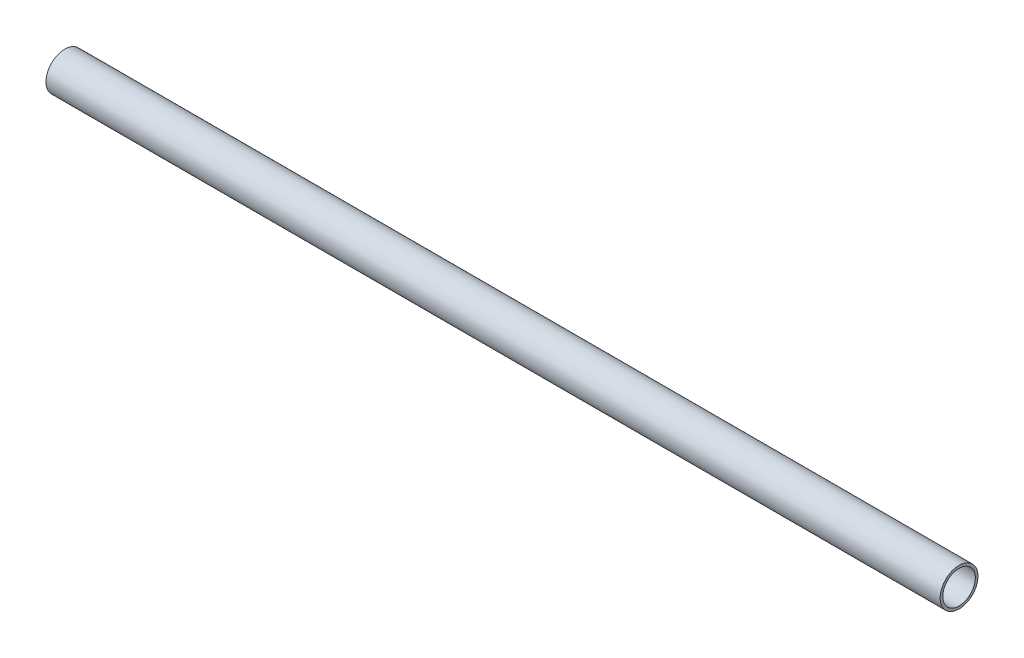
ISO-10303-21;
HEADER;
FILE_DESCRIPTION(('STEP AP214'),'2;1');
FILE_NAME('part.step','',(''),(''),'','','');
FILE_SCHEMA(('AUTOMOTIVE_DESIGN { 1 0 10303 214 1 1 1 1 }'));
ENDSEC;
DATA;
#1=APPLICATION_CONTEXT('core data for automotive mechanical design processes');
#2=APPLICATION_PROTOCOL_DEFINITION('international standard','automotive_design',2000,#1);
#3=PRODUCT_CONTEXT('',#1,'mechanical');
#4=PRODUCT('Part','Part','',(#3));
#5=PRODUCT_RELATED_PRODUCT_CATEGORY('part','',(#4));
#6=PRODUCT_DEFINITION_FORMATION('','',#4);
#7=PRODUCT_DEFINITION_CONTEXT('part definition',#1,'design');
#8=PRODUCT_DEFINITION('design','',#6,#7);
#9=PRODUCT_DEFINITION_SHAPE('','',#8);
#10=(LENGTH_UNIT() NAMED_UNIT(*) SI_UNIT(.MILLI.,.METRE.));
#11=(NAMED_UNIT(*) PLANE_ANGLE_UNIT() SI_UNIT($,.RADIAN.));
#12=(NAMED_UNIT(*) SI_UNIT($,.STERADIAN.) SOLID_ANGLE_UNIT());
#13=UNCERTAINTY_MEASURE_WITH_UNIT(LENGTH_MEASURE(1.E-05),#10,'distance_accuracy_value','');
#14=(GEOMETRIC_REPRESENTATION_CONTEXT(3) GLOBAL_UNCERTAINTY_ASSIGNED_CONTEXT((#13)) GLOBAL_UNIT_ASSIGNED_CONTEXT((#10,
#11,#12)) REPRESENTATION_CONTEXT('',''));
#15=CARTESIAN_POINT('',(0.,0.,0.));
#16=DIRECTION('',(0.,0.,1.));
#17=DIRECTION('',(1.,0.,0.));
#18=AXIS2_PLACEMENT_3D('',#15,#16,#17);
#19=CARTESIAN_POINT('',(-450.,0.,0.));
#20=DIRECTION('',(1.,0.,0.));
#21=DIRECTION('',(0.,0.,-1.));
#22=AXIS2_PLACEMENT_3D('',#19,#20,#21);
#23=CYLINDRICAL_SURFACE('',#22,6.35000000000002);
#24=CARTESIAN_POINT('',(-450.,0.,0.));
#25=DIRECTION('',(1.,0.,0.));
#26=DIRECTION('',(0.,0.,-1.));
#27=AXIS2_PLACEMENT_3D('',#24,#25,#26);
#28=CIRCLE('',#27,6.35);
#29=CARTESIAN_POINT('',(-450.,0.,-6.35));
#30=VERTEX_POINT('',#29);
#31=EDGE_CURVE('E10',#30,#30,#28,.T.);
#32=ORIENTED_EDGE('',*,*,#31,.T.);
#33=EDGE_LOOP('',(#32));
#34=FACE_BOUND('',#33,.T.);
#35=CARTESIAN_POINT('',(-150.,0.,0.));
#36=DIRECTION('',(1.,0.,0.));
#37=DIRECTION('',(0.,0.,-1.));
#38=AXIS2_PLACEMENT_3D('',#35,#36,#37);
#39=CIRCLE('',#38,6.35000000000004);
#40=CARTESIAN_POINT('',(-150.,0.,-6.35000000000004));
#41=VERTEX_POINT('',#40);
#42=EDGE_CURVE('E47',#41,#41,#39,.T.);
#43=ORIENTED_EDGE('',*,*,#42,.F.);
#44=EDGE_LOOP('',(#43));
#45=FACE_BOUND('',#44,.T.);
#46=ADVANCED_FACE('F33',(#34,#45),#23,.T.);
#47=CARTESIAN_POINT('',(-450.,6.35,0.));
#48=DIRECTION('',(-1.,0.,0.));
#49=DIRECTION('',(0.,0.,1.));
#50=AXIS2_PLACEMENT_3D('',#47,#48,#49);
#51=PLANE('',#50);
#52=CARTESIAN_POINT('',(-450.,0.,0.));
#53=DIRECTION('',(1.,0.,0.));
#54=DIRECTION('',(0.,0.,-1.));
#55=AXIS2_PLACEMENT_3D('',#52,#53,#54);
#56=CIRCLE('',#55,5.461);
#57=CARTESIAN_POINT('',(-450.,0.,-5.461));
#58=VERTEX_POINT('',#57);
#59=EDGE_CURVE('E39',#58,#58,#56,.T.);
#60=ORIENTED_EDGE('',*,*,#59,.T.);
#61=EDGE_LOOP('',(#60));
#62=FACE_BOUND('',#61,.T.);
#63=ORIENTED_EDGE('',*,*,#31,.F.);
#64=EDGE_LOOP('',(#63));
#65=FACE_BOUND('',#64,.T.);
#66=ADVANCED_FACE('F57',(#62,#65),#51,.T.);
#67=CARTESIAN_POINT('',(-450.,0.,0.));
#68=DIRECTION('',(1.,0.,0.));
#69=DIRECTION('',(0.,0.,-1.));
#70=AXIS2_PLACEMENT_3D('',#67,#68,#69);
#71=CYLINDRICAL_SURFACE('',#70,5.461);
#72=CARTESIAN_POINT('',(-150.,0.,0.));
#73=DIRECTION('',(1.,0.,0.));
#74=DIRECTION('',(0.,0.,-1.));
#75=AXIS2_PLACEMENT_3D('',#72,#73,#74);
#76=CIRCLE('',#75,5.461);
#77=CARTESIAN_POINT('',(-150.,0.,-5.461));
#78=VERTEX_POINT('',#77);
#79=EDGE_CURVE('E43',#78,#78,#76,.T.);
#80=ORIENTED_EDGE('',*,*,#79,.T.);
#81=EDGE_LOOP('',(#80));
#82=FACE_BOUND('',#81,.T.);
#83=ORIENTED_EDGE('',*,*,#59,.F.);
#84=EDGE_LOOP('',(#83));
#85=FACE_BOUND('',#84,.T.);
#86=ADVANCED_FACE('F61',(#82,#85),#71,.F.);
#87=CARTESIAN_POINT('',(-150.,5.461,0.));
#88=DIRECTION('',(1.,0.,0.));
#89=DIRECTION('',(0.,0.,-1.));
#90=AXIS2_PLACEMENT_3D('',#87,#88,#89);
#91=PLANE('',#90);
#92=ORIENTED_EDGE('',*,*,#42,.T.);
#93=EDGE_LOOP('',(#92));
#94=FACE_BOUND('',#93,.T.);
#95=ORIENTED_EDGE('',*,*,#79,.F.);
#96=EDGE_LOOP('',(#95));
#97=FACE_BOUND('',#96,.T.);
#98=ADVANCED_FACE('F53',(#94,#97),#91,.T.);
#99=CLOSED_SHELL('',(#46,#66,#86,#98));
#100=MANIFOLD_SOLID_BREP('B2',#99);
#101=ADVANCED_BREP_SHAPE_REPRESENTATION('',(#18,#100),#14);
#102=SHAPE_DEFINITION_REPRESENTATION(#9,#101);
ENDSEC;
END-ISO-10303-21;
